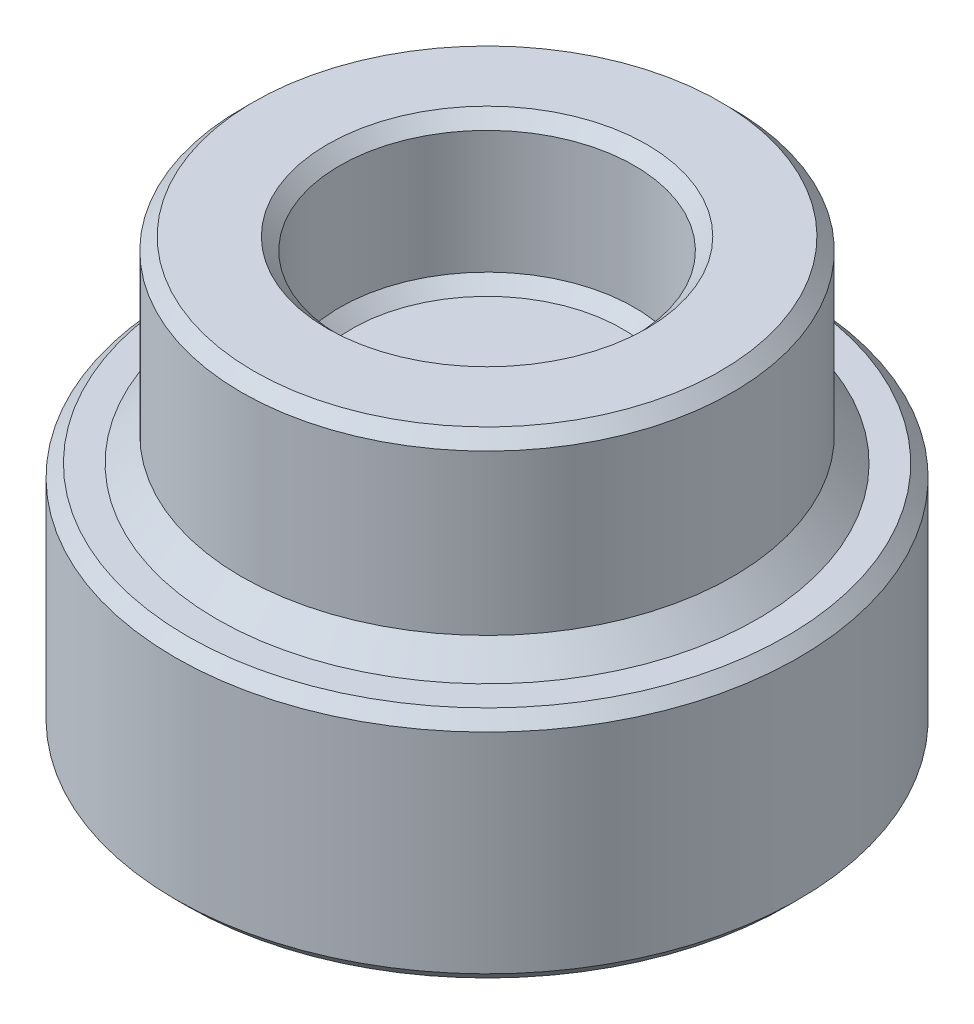
ISO-10303-21;
HEADER;
FILE_DESCRIPTION(('STEP AP214'),'2;1');
FILE_NAME('part.step','',(''),(''),'','','');
FILE_SCHEMA(('AUTOMOTIVE_DESIGN { 1 0 10303 214 1 1 1 1 }'));
ENDSEC;
DATA;
#1=APPLICATION_CONTEXT('core data for automotive mechanical design processes');
#2=APPLICATION_PROTOCOL_DEFINITION('international standard','automotive_design',2000,#1);
#3=PRODUCT_CONTEXT('',#1,'mechanical');
#4=PRODUCT('Part','Part','',(#3));
#5=PRODUCT_RELATED_PRODUCT_CATEGORY('part','',(#4));
#6=PRODUCT_DEFINITION_FORMATION('','',#4);
#7=PRODUCT_DEFINITION_CONTEXT('part definition',#1,'design');
#8=PRODUCT_DEFINITION('design','',#6,#7);
#9=PRODUCT_DEFINITION_SHAPE('','',#8);
#10=(LENGTH_UNIT() NAMED_UNIT(*) SI_UNIT(.MILLI.,.METRE.));
#11=(NAMED_UNIT(*) PLANE_ANGLE_UNIT() SI_UNIT($,.RADIAN.));
#12=(NAMED_UNIT(*) SI_UNIT($,.STERADIAN.) SOLID_ANGLE_UNIT());
#13=UNCERTAINTY_MEASURE_WITH_UNIT(LENGTH_MEASURE(1.E-05),#10,'distance_accuracy_value','');
#14=(GEOMETRIC_REPRESENTATION_CONTEXT(3) GLOBAL_UNCERTAINTY_ASSIGNED_CONTEXT((#13)) GLOBAL_UNIT_ASSIGNED_CONTEXT((#10,
#11,#12)) REPRESENTATION_CONTEXT('',''));
#15=CARTESIAN_POINT('',(0.,0.,0.));
#16=DIRECTION('',(0.,0.,1.));
#17=DIRECTION('',(1.,0.,0.));
#18=AXIS2_PLACEMENT_3D('',#15,#16,#17);
#19=CARTESIAN_POINT('',(0.,1.,0.));
#20=DIRECTION('',(0.,-1.,0.));
#21=DIRECTION('',(0.,0.,-1.));
#22=AXIS2_PLACEMENT_3D('',#19,#20,#21);
#23=CYLINDRICAL_SURFACE('',#22,5.);
#24=CARTESIAN_POINT('',(0.,0.500000000000003,0.));
#25=DIRECTION('',(0.,1.,0.));
#26=DIRECTION('',(0.,0.,1.));
#27=AXIS2_PLACEMENT_3D('',#24,#25,#26);
#28=CIRCLE('',#27,5.);
#29=CARTESIAN_POINT('',(0.,0.500000000000003,5.));
#30=VERTEX_POINT('',#29);
#31=EDGE_CURVE('E69',#30,#30,#28,.T.);
#32=ORIENTED_EDGE('',*,*,#31,.T.);
#33=EDGE_LOOP('',(#32));
#34=FACE_BOUND('',#33,.T.);
#35=CARTESIAN_POINT('',(0.,3.75,0.));
#36=DIRECTION('',(0.,1.,0.));
#37=DIRECTION('',(0.,0.,1.));
#38=AXIS2_PLACEMENT_3D('',#35,#36,#37);
#39=CIRCLE('',#38,5.);
#40=CARTESIAN_POINT('',(0.,3.75,5.));
#41=VERTEX_POINT('',#40);
#42=EDGE_CURVE('E101',#41,#41,#39,.F.);
#43=ORIENTED_EDGE('',*,*,#42,.T.);
#44=EDGE_LOOP('',(#43));
#45=FACE_BOUND('',#44,.T.);
#46=ADVANCED_FACE('F61',(#34,#45),#23,.T.);
#47=CARTESIAN_POINT('',(0.,4.,0.));
#48=DIRECTION('',(0.,1.,0.));
#49=DIRECTION('',(0.,0.,1.));
#50=AXIS2_PLACEMENT_3D('',#47,#48,#49);
#51=PLANE('',#50);
#52=CARTESIAN_POINT('',(0.,4.,0.));
#53=DIRECTION('',(0.,1.,0.));
#54=DIRECTION('',(0.,0.,1.));
#55=AXIS2_PLACEMENT_3D('',#52,#53,#54);
#56=CIRCLE('',#55,3.25);
#57=CARTESIAN_POINT('',(0.,4.,3.25));
#58=VERTEX_POINT('',#57);
#59=EDGE_CURVE('E98',#58,#58,#56,.F.);
#60=ORIENTED_EDGE('',*,*,#59,.T.);
#61=EDGE_LOOP('',(#60));
#62=FACE_BOUND('',#61,.T.);
#63=CARTESIAN_POINT('',(0.,4.,0.));
#64=DIRECTION('',(0.,1.,0.));
#65=DIRECTION('',(0.,0.,1.));
#66=AXIS2_PLACEMENT_3D('',#63,#64,#65);
#67=CIRCLE('',#66,4.75);
#68=CARTESIAN_POINT('',(0.,4.,4.75));
#69=VERTEX_POINT('',#68);
#70=EDGE_CURVE('E95',#69,#69,#67,.T.);
#71=ORIENTED_EDGE('',*,*,#70,.T.);
#72=EDGE_LOOP('',(#71));
#73=FACE_BOUND('',#72,.T.);
#74=ADVANCED_FACE('F134',(#62,#73),#51,.T.);
#75=CARTESIAN_POINT('',(0.,4.,0.));
#76=DIRECTION('',(0.,-1.,0.));
#77=DIRECTION('',(0.,0.,-1.));
#78=AXIS2_PLACEMENT_3D('',#75,#76,#77);
#79=CYLINDRICAL_SURFACE('',#78,3.);
#80=CARTESIAN_POINT('',(0.,3.75,0.));
#81=DIRECTION('',(0.,1.,0.));
#82=DIRECTION('',(0.,0.,1.));
#83=AXIS2_PLACEMENT_3D('',#80,#81,#82);
#84=CIRCLE('',#83,3.);
#85=CARTESIAN_POINT('',(0.,3.75,3.));
#86=VERTEX_POINT('',#85);
#87=EDGE_CURVE('E86',#86,#86,#84,.T.);
#88=ORIENTED_EDGE('',*,*,#87,.T.);
#89=EDGE_LOOP('',(#88));
#90=FACE_BOUND('',#89,.T.);
#91=CARTESIAN_POINT('',(0.,1.25,0.));
#92=DIRECTION('',(0.,1.,0.));
#93=DIRECTION('',(0.,0.,1.));
#94=AXIS2_PLACEMENT_3D('',#91,#92,#93);
#95=CIRCLE('',#94,3.);
#96=CARTESIAN_POINT('',(0.,1.25,3.));
#97=VERTEX_POINT('',#96);
#98=EDGE_CURVE('E82',#97,#97,#95,.F.);
#99=ORIENTED_EDGE('',*,*,#98,.T.);
#100=EDGE_LOOP('',(#99));
#101=FACE_BOUND('',#100,.T.);
#102=ADVANCED_FACE('F139',(#90,#101),#79,.F.);
#103=CARTESIAN_POINT('',(0.,1.,0.));
#104=DIRECTION('',(0.,1.,0.));
#105=DIRECTION('',(0.,0.,1.));
#106=AXIS2_PLACEMENT_3D('',#103,#104,#105);
#107=PLANE('',#106);
#108=CARTESIAN_POINT('',(0.,1.,0.));
#109=DIRECTION('',(0.,1.,0.));
#110=DIRECTION('',(0.,0.,1.));
#111=AXIS2_PLACEMENT_3D('',#108,#109,#110);
#112=CIRCLE('',#111,2.75);
#113=CARTESIAN_POINT('',(0.,1.,2.75));
#114=VERTEX_POINT('',#113);
#115=EDGE_CURVE('E104',#114,#114,#112,.T.);
#116=ORIENTED_EDGE('',*,*,#115,.T.);
#117=EDGE_LOOP('',(#116));
#118=FACE_BOUND('',#117,.T.);
#119=ADVANCED_FACE('F144',(#118),#107,.T.);
#120=CARTESIAN_POINT('',(0.,3.75,0.));
#121=DIRECTION('',(0.,1.,0.));
#122=DIRECTION('',(0.,0.,1.));
#123=AXIS2_PLACEMENT_3D('',#120,#121,#122);
#124=CONICAL_SURFACE('',#123,3.,0.785398163397455);
#125=ORIENTED_EDGE('',*,*,#59,.F.);
#126=EDGE_LOOP('',(#125));
#127=FACE_BOUND('',#126,.T.);
#128=ORIENTED_EDGE('',*,*,#87,.F.);
#129=EDGE_LOOP('',(#128));
#130=FACE_BOUND('',#129,.T.);
#131=ADVANCED_FACE('F146',(#127,#130),#124,.F.);
#132=CARTESIAN_POINT('',(0.,4.,0.));
#133=DIRECTION('',(0.,-1.,0.));
#134=DIRECTION('',(0.,0.,-1.));
#135=AXIS2_PLACEMENT_3D('',#132,#133,#134);
#136=CONICAL_SURFACE('',#135,4.75,0.785398163397441);
#137=ORIENTED_EDGE('',*,*,#42,.F.);
#138=EDGE_LOOP('',(#137));
#139=FACE_BOUND('',#138,.T.);
#140=ORIENTED_EDGE('',*,*,#70,.F.);
#141=EDGE_LOOP('',(#140));
#142=FACE_BOUND('',#141,.T.);
#143=ADVANCED_FACE('F152',(#139,#142),#136,.T.);
#144=CARTESIAN_POINT('',(0.,1.25,0.));
#145=DIRECTION('',(0.,1.,0.));
#146=DIRECTION('',(0.,0.,1.));
#147=AXIS2_PLACEMENT_3D('',#144,#145,#146);
#148=CONICAL_SURFACE('',#147,3.,0.785398163397443);
#149=ORIENTED_EDGE('',*,*,#115,.F.);
#150=EDGE_LOOP('',(#149));
#151=FACE_BOUND('',#150,.T.);
#152=ORIENTED_EDGE('',*,*,#98,.F.);
#153=EDGE_LOOP('',(#152));
#154=FACE_BOUND('',#153,.T.);
#155=ADVANCED_FACE('F159',(#151,#154),#148,.F.);
#156=CARTESIAN_POINT('',(0.,-4.7625,0.));
#157=DIRECTION('',(0.,1.,0.));
#158=DIRECTION('',(0.,0.,1.));
#159=AXIS2_PLACEMENT_3D('',#156,#157,#158);
#160=CYLINDRICAL_SURFACE('',#159,6.35);
#161=CARTESIAN_POINT('',(0.,-4.51249999999999,0.));
#162=DIRECTION('',(0.,1.,0.));
#163=DIRECTION('',(0.,0.,1.));
#164=AXIS2_PLACEMENT_3D('',#161,#162,#163);
#165=CIRCLE('',#164,6.35);
#166=CARTESIAN_POINT('',(0.,-4.51249999999999,6.35));
#167=VERTEX_POINT('',#166);
#168=EDGE_CURVE('E110',#167,#167,#165,.T.);
#169=CARTESIAN_POINT('',(0.,-0.249999999999988,0.));
#170=DIRECTION('',(0.,1.,0.));
#171=DIRECTION('',(0.,0.,1.));
#172=AXIS2_PLACEMENT_3D('',#169,#170,#171);
#173=CIRCLE('',#172,6.35);
#174=CARTESIAN_POINT('',(0.,-0.249999999999988,6.35));
#175=VERTEX_POINT('',#174);
#176=EDGE_CURVE('E107',#175,#175,#173,.F.);
#177=CARTESIAN_POINT('',(0.,-4.51249999999999,6.35));
#178=CARTESIAN_POINT('',(0.,-4.46809895833333,6.35));
#179=CARTESIAN_POINT('',(0.,-4.42369791666666,6.35));
#180=CARTESIAN_POINT('',(0.,-4.33489583333333,6.35));
#181=CARTESIAN_POINT('',(0.,-4.29049479166666,6.35));
#182=CARTESIAN_POINT('',(0.,-4.20169270833333,6.35));
#183=CARTESIAN_POINT('',(0.,-4.15729166666666,6.35));
#184=CARTESIAN_POINT('',(0.,-4.06848958333333,6.35));
#185=CARTESIAN_POINT('',(0.,-4.02408854166666,6.35));
#186=CARTESIAN_POINT('',(0.,-3.93528645833333,6.35));
#187=CARTESIAN_POINT('',(0.,-3.89088541666666,6.35));
#188=CARTESIAN_POINT('',(0.,-3.80208333333333,6.35));
#189=CARTESIAN_POINT('',(0.,-3.75768229166666,6.35));
#190=CARTESIAN_POINT('',(0.,-3.66888020833333,6.35));
#191=CARTESIAN_POINT('',(0.,-3.62447916666666,6.35));
#192=CARTESIAN_POINT('',(0.,-3.53567708333333,6.35));
#193=CARTESIAN_POINT('',(0.,-3.49127604166666,6.35));
#194=CARTESIAN_POINT('',(0.,-3.40247395833333,6.35));
#195=CARTESIAN_POINT('',(0.,-3.35807291666666,6.35));
#196=CARTESIAN_POINT('',(0.,-3.26927083333333,6.35));
#197=CARTESIAN_POINT('',(0.,-3.22486979166666,6.35));
#198=CARTESIAN_POINT('',(0.,-3.13606770833333,6.35));
#199=CARTESIAN_POINT('',(0.,-3.09166666666666,6.35));
#200=CARTESIAN_POINT('',(0.,-3.00286458333333,6.35));
#201=CARTESIAN_POINT('',(0.,-2.95846354166666,6.35));
#202=CARTESIAN_POINT('',(0.,-2.86966145833333,6.35));
#203=CARTESIAN_POINT('',(0.,-2.82526041666666,6.35));
#204=CARTESIAN_POINT('',(0.,-2.73645833333333,6.35));
#205=CARTESIAN_POINT('',(0.,-2.69205729166666,6.35));
#206=CARTESIAN_POINT('',(0.,-2.60325520833333,6.35));
#207=CARTESIAN_POINT('',(0.,-2.55885416666666,6.35));
#208=CARTESIAN_POINT('',(0.,-2.47005208333333,6.35));
#209=CARTESIAN_POINT('',(0.,-2.42565104166666,6.35));
#210=CARTESIAN_POINT('',(0.,-2.33684895833333,6.35));
#211=CARTESIAN_POINT('',(0.,-2.29244791666666,6.35));
#212=CARTESIAN_POINT('',(0.,-2.20364583333332,6.35));
#213=CARTESIAN_POINT('',(0.,-2.15924479166666,6.35));
#214=CARTESIAN_POINT('',(0.,-2.07044270833332,6.35));
#215=CARTESIAN_POINT('',(0.,-2.02604166666666,6.35));
#216=CARTESIAN_POINT('',(0.,-1.93723958333332,6.35));
#217=CARTESIAN_POINT('',(0.,-1.89283854166666,6.35));
#218=CARTESIAN_POINT('',(0.,-1.80403645833332,6.35));
#219=CARTESIAN_POINT('',(0.,-1.75963541666666,6.35));
#220=CARTESIAN_POINT('',(0.,-1.67083333333332,6.35));
#221=CARTESIAN_POINT('',(0.,-1.62643229166666,6.35));
#222=CARTESIAN_POINT('',(0.,-1.53763020833332,6.35));
#223=CARTESIAN_POINT('',(0.,-1.49322916666666,6.35));
#224=CARTESIAN_POINT('',(0.,-1.40442708333332,6.35));
#225=CARTESIAN_POINT('',(0.,-1.36002604166666,6.35));
#226=CARTESIAN_POINT('',(0.,-1.27122395833332,6.35));
#227=CARTESIAN_POINT('',(0.,-1.22682291666666,6.35));
#228=CARTESIAN_POINT('',(0.,-1.13802083333332,6.35));
#229=CARTESIAN_POINT('',(0.,-1.09361979166666,6.35));
#230=CARTESIAN_POINT('',(0.,-1.00481770833332,6.35));
#231=CARTESIAN_POINT('',(0.,-0.960416666666656,6.35));
#232=CARTESIAN_POINT('',(0.,-0.871614583333323,6.35));
#233=CARTESIAN_POINT('',(0.,-0.827213541666656,6.35));
#234=CARTESIAN_POINT('',(0.,-0.738411458333323,6.35));
#235=CARTESIAN_POINT('',(0.,-0.694010416666656,6.35));
#236=CARTESIAN_POINT('',(0.,-0.605208333333322,6.35));
#237=CARTESIAN_POINT('',(0.,-0.560807291666655,6.35));
#238=CARTESIAN_POINT('',(0.,-0.472005208333322,6.35));
#239=CARTESIAN_POINT('',(0.,-0.427604166666655,6.35));
#240=CARTESIAN_POINT('',(0.,-0.338802083333321,6.35));
#241=CARTESIAN_POINT('',(0.,-0.294401041666655,6.35));
#242=CARTESIAN_POINT('',(0.,-0.249999999999988,6.35));
#243=B_SPLINE_CURVE_WITH_KNOTS('',3,(#177,#178,#179,#180,#181,#182,#183,#184,#185,#186,#187,
#188,#189,#190,#191,#192,#193,#194,#195,#196,#197,#198,#199,#200,#201,#202,#203,#204,#205,#206,
#207,#208,#209,#210,#211,#212,#213,#214,#215,#216,#217,#218,#219,#220,#221,#222,#223,#224,#225,
#226,#227,#228,#229,#230,#231,#232,#233,#234,#235,#236,#237,#238,#239,#240,#241,#242),
.UNSPECIFIED.,.F.,.F.,(4,2,2,2,2,2,2,2,2,2,2,2,2,2,2,2,2,2,2,2,2,2,2,2,2,2,2,2,2,2,2,2,4),(0.,
0.133203125,0.26640625,0.399609375,0.5328125,0.666015625000001,0.799218750000001,
0.932421875000001,1.065625,1.198828125,1.33203125,1.465234375,1.5984375,1.731640625,1.86484375,
1.998046875,2.13125,2.264453125,2.39765625,2.530859375,2.6640625,2.797265625,2.93046875,
3.063671875,3.196875,3.330078125,3.46328125000001,3.59648437500001,3.72968750000001,
3.86289062500001,3.99609375000001,4.12929687500001,4.26250000000001),.UNSPECIFIED.);
#244=EDGE_CURVE('BSEAM166',#167,#175,#243,.T.);
#245=ORIENTED_EDGE('',*,*,#168,.T.);
#246=ORIENTED_EDGE('',*,*,#176,.T.);
#247=ORIENTED_EDGE('',*,*,#244,.T.);
#248=ORIENTED_EDGE('',*,*,#244,.F.);
#249=EDGE_LOOP('',(#245,#247,#246,#248));
#250=FACE_BOUND('',#249,.T.);
#251=ADVANCED_FACE('F166',(#250),#160,.T.);
#252=CARTESIAN_POINT('',(0.,-4.7625,0.));
#253=DIRECTION('',(0.,1.,0.));
#254=DIRECTION('',(0.,0.,1.));
#255=AXIS2_PLACEMENT_3D('',#252,#253,#254);
#256=PLANE('',#255);
#257=CARTESIAN_POINT('',(0.,-4.7625,0.));
#258=DIRECTION('',(0.,1.,0.));
#259=DIRECTION('',(0.,0.,1.));
#260=AXIS2_PLACEMENT_3D('',#257,#258,#259);
#261=CIRCLE('',#260,6.1);
#262=CARTESIAN_POINT('',(0.,-4.7625,6.1));
#263=VERTEX_POINT('',#262);
#264=EDGE_CURVE('E113',#263,#263,#261,.F.);
#265=ORIENTED_EDGE('',*,*,#264,.T.);
#266=EDGE_LOOP('',(#265));
#267=FACE_BOUND('',#266,.T.);
#268=CARTESIAN_POINT('',(0.,-4.7625,0.));
#269=DIRECTION('',(0.,-1.,0.));
#270=DIRECTION('',(0.,0.,-1.));
#271=AXIS2_PLACEMENT_3D('',#268,#269,#270);
#272=CIRCLE('',#271,2.);
#273=CARTESIAN_POINT('',(0.,-4.7625,-2.));
#274=VERTEX_POINT('',#273);
#275=EDGE_CURVE('E89',#274,#274,#272,.T.);
#276=ORIENTED_EDGE('',*,*,#275,.F.);
#277=EDGE_LOOP('',(#276));
#278=FACE_BOUND('',#277,.T.);
#279=ADVANCED_FACE('F190',(#267,#278),#256,.F.);
#280=CARTESIAN_POINT('',(0.,0.,0.));
#281=DIRECTION('',(0.,1.,0.));
#282=DIRECTION('',(0.,0.,1.));
#283=AXIS2_PLACEMENT_3D('',#280,#281,#282);
#284=PLANE('',#283);
#285=CARTESIAN_POINT('',(0.,0.,0.));
#286=DIRECTION('',(0.,1.,0.));
#287=DIRECTION('',(0.,0.,1.));
#288=AXIS2_PLACEMENT_3D('',#285,#286,#287);
#289=CIRCLE('',#288,5.5);
#290=CARTESIAN_POINT('',(0.,0.,5.5));
#291=VERTEX_POINT('',#290);
#292=EDGE_CURVE('E12',#291,#291,#289,.F.);
#293=ORIENTED_EDGE('',*,*,#292,.T.);
#294=EDGE_LOOP('',(#293));
#295=FACE_BOUND('',#294,.T.);
#296=CARTESIAN_POINT('',(0.,0.,0.));
#297=DIRECTION('',(0.,1.,0.));
#298=DIRECTION('',(0.,0.,1.));
#299=AXIS2_PLACEMENT_3D('',#296,#297,#298);
#300=CIRCLE('',#299,6.10000000000001);
#301=CARTESIAN_POINT('',(0.,0.,6.10000000000001));
#302=VERTEX_POINT('',#301);
#303=EDGE_CURVE('E116',#302,#302,#300,.T.);
#304=ORIENTED_EDGE('',*,*,#303,.T.);
#305=EDGE_LOOP('',(#304));
#306=FACE_BOUND('',#305,.T.);
#307=ADVANCED_FACE('F76',(#295,#306),#284,.T.);
#308=CARTESIAN_POINT('',(0.,-0.311072216239814,0.));
#309=DIRECTION('',(0.,-1.,0.));
#310=DIRECTION('',(0.,0.,-1.));
#311=AXIS2_PLACEMENT_3D('',#308,#309,#310);
#312=CONICAL_SURFACE('',#311,1.75,1.39626340159546);
#313=CARTESIAN_POINT('',(0.,-0.00250000000000077,0.));
#314=VERTEX_POINT('',#313);
#315=VERTEX_LOOP('',#314);
#316=FACE_BOUND('',#315,.T.);
#317=CARTESIAN_POINT('',(0.,-0.311072216239814,0.));
#318=DIRECTION('',(0.,-1.,0.));
#319=DIRECTION('',(0.,0.,-1.));
#320=AXIS2_PLACEMENT_3D('',#317,#318,#319);
#321=CIRCLE('',#320,1.75);
#322=CARTESIAN_POINT('',(0.,-0.311072216239814,-1.75));
#323=VERTEX_POINT('',#322);
#324=EDGE_CURVE('E80',#323,#323,#321,.T.);
#325=ORIENTED_EDGE('',*,*,#324,.T.);
#326=EDGE_LOOP('',(#325));
#327=FACE_BOUND('',#326,.T.);
#328=ADVANCED_FACE('F72',(#316,#327),#312,.F.);
#329=CARTESIAN_POINT('',(0.,-4.7625,0.));
#330=DIRECTION('',(0.,-1.,0.));
#331=DIRECTION('',(0.,0.,-1.));
#332=AXIS2_PLACEMENT_3D('',#329,#330,#331);
#333=CYLINDRICAL_SURFACE('',#332,1.75);
#334=ORIENTED_EDGE('',*,*,#324,.F.);
#335=EDGE_LOOP('',(#334));
#336=FACE_BOUND('',#335,.T.);
#337=CARTESIAN_POINT('',(0.,-4.5125,0.));
#338=DIRECTION('',(0.,-1.,0.));
#339=DIRECTION('',(0.,0.,-1.));
#340=AXIS2_PLACEMENT_3D('',#337,#338,#339);
#341=CIRCLE('',#340,1.75);
#342=CARTESIAN_POINT('',(0.,-4.5125,-1.75));
#343=VERTEX_POINT('',#342);
#344=EDGE_CURVE('E83',#343,#343,#341,.T.);
#345=ORIENTED_EDGE('',*,*,#344,.T.);
#346=EDGE_LOOP('',(#345));
#347=FACE_BOUND('',#346,.T.);
#348=ADVANCED_FACE('F75',(#336,#347),#333,.F.);
#349=CARTESIAN_POINT('',(0.,-4.7625,0.));
#350=DIRECTION('',(0.,-1.,0.));
#351=DIRECTION('',(0.,0.,-1.));
#352=AXIS2_PLACEMENT_3D('',#349,#350,#351);
#353=CONICAL_SURFACE('',#352,2.,0.785398163397451);
#354=ORIENTED_EDGE('',*,*,#344,.F.);
#355=EDGE_LOOP('',(#354));
#356=FACE_BOUND('',#355,.T.);
#357=ORIENTED_EDGE('',*,*,#275,.T.);
#358=EDGE_LOOP('',(#357));
#359=FACE_BOUND('',#358,.T.);
#360=ADVANCED_FACE('F172',(#356,#359),#353,.F.);
#361=CARTESIAN_POINT('',(0.,-4.51249999999999,0.));
#362=DIRECTION('',(0.,1.,0.));
#363=DIRECTION('',(0.,0.,1.));
#364=AXIS2_PLACEMENT_3D('',#361,#362,#363);
#365=CONICAL_SURFACE('',#364,6.35,0.785398163397447);
#366=ORIENTED_EDGE('',*,*,#264,.F.);
#367=EDGE_LOOP('',(#366));
#368=FACE_BOUND('',#367,.T.);
#369=ORIENTED_EDGE('',*,*,#168,.F.);
#370=EDGE_LOOP('',(#369));
#371=FACE_BOUND('',#370,.T.);
#372=ADVANCED_FACE('F130',(#368,#371),#365,.T.);
#373=CARTESIAN_POINT('',(0.,0.,0.));
#374=DIRECTION('',(0.,-1.,0.));
#375=DIRECTION('',(0.,0.,-1.));
#376=AXIS2_PLACEMENT_3D('',#373,#374,#375);
#377=CONICAL_SURFACE('',#376,6.10000000000001,0.78539816339745);
#378=ORIENTED_EDGE('',*,*,#176,.F.);
#379=EDGE_LOOP('',(#378));
#380=FACE_BOUND('',#379,.T.);
#381=ORIENTED_EDGE('',*,*,#303,.F.);
#382=EDGE_LOOP('',(#381));
#383=FACE_BOUND('',#382,.T.);
#384=ADVANCED_FACE('F124',(#380,#383),#377,.T.);
#385=CARTESIAN_POINT('',(0.,0.500000000000003,0.));
#386=DIRECTION('',(0.,-1.,0.));
#387=DIRECTION('',(0.,0.,-1.));
#388=AXIS2_PLACEMENT_3D('',#385,#386,#387);
#389=CONICAL_SURFACE('',#388,5.,0.785398163397441);
#390=ORIENTED_EDGE('',*,*,#292,.F.);
#391=EDGE_LOOP('',(#390));
#392=FACE_BOUND('',#391,.T.);
#393=ORIENTED_EDGE('',*,*,#31,.F.);
#394=EDGE_LOOP('',(#393));
#395=FACE_BOUND('',#394,.T.);
#396=ADVANCED_FACE('F64',(#392,#395),#389,.T.);
#397=CLOSED_SHELL('',(#46,#74,#102,#119,#131,#143,#155,#251,#279,#307,#328,#348,#360,#372,#384,#396));
#398=MANIFOLD_SOLID_BREP('B2',#397);
#399=ADVANCED_BREP_SHAPE_REPRESENTATION('',(#18,#398),#14);
#400=SHAPE_DEFINITION_REPRESENTATION(#9,#399);
ENDSEC;
END-ISO-10303-21;
